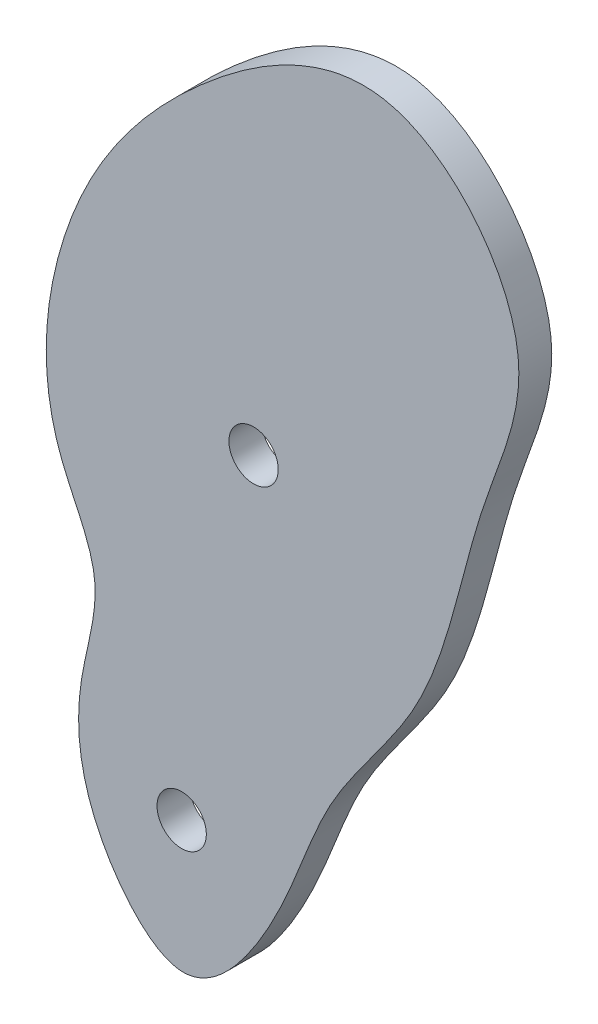
ISO-10303-21;
HEADER;
FILE_DESCRIPTION(('STEP AP214'),'2;1');
FILE_NAME('part.step','',(''),(''),'','','');
FILE_SCHEMA(('AUTOMOTIVE_DESIGN { 1 0 10303 214 1 1 1 1 }'));
ENDSEC;
DATA;
#1=APPLICATION_CONTEXT('core data for automotive mechanical design processes');
#2=APPLICATION_PROTOCOL_DEFINITION('international standard','automotive_design',2000,#1);
#3=PRODUCT_CONTEXT('',#1,'mechanical');
#4=PRODUCT('Part','Part','',(#3));
#5=PRODUCT_RELATED_PRODUCT_CATEGORY('part','',(#4));
#6=PRODUCT_DEFINITION_FORMATION('','',#4);
#7=PRODUCT_DEFINITION_CONTEXT('part definition',#1,'design');
#8=PRODUCT_DEFINITION('design','',#6,#7);
#9=PRODUCT_DEFINITION_SHAPE('','',#8);
#10=(LENGTH_UNIT() NAMED_UNIT(*) SI_UNIT(.MILLI.,.METRE.));
#11=(NAMED_UNIT(*) PLANE_ANGLE_UNIT() SI_UNIT($,.RADIAN.));
#12=(NAMED_UNIT(*) SI_UNIT($,.STERADIAN.) SOLID_ANGLE_UNIT());
#13=UNCERTAINTY_MEASURE_WITH_UNIT(LENGTH_MEASURE(1.E-05),#10,'distance_accuracy_value','');
#14=(GEOMETRIC_REPRESENTATION_CONTEXT(3) GLOBAL_UNCERTAINTY_ASSIGNED_CONTEXT((#13)) GLOBAL_UNIT_ASSIGNED_CONTEXT((#10,
#11,#12)) REPRESENTATION_CONTEXT('',''));
#15=CARTESIAN_POINT('',(0.,0.,0.));
#16=DIRECTION('',(0.,0.,1.));
#17=DIRECTION('',(1.,0.,0.));
#18=AXIS2_PLACEMENT_3D('',#15,#16,#17);
#19=CARTESIAN_POINT('',(325.212447172402,285.760603231583,3.175));
#20=DIRECTION('',(0.,0.,1.));
#21=DIRECTION('',(1.,0.,0.));
#22=AXIS2_PLACEMENT_3D('',#19,#20,#21);
#23=PLANE('',#22);
#24=CARTESIAN_POINT('',(299.663894036164,264.847271209584,3.175));
#25=DIRECTION('',(0.,0.,1.));
#26=DIRECTION('',(1.,0.,0.));
#27=AXIS2_PLACEMENT_3D('',#24,#25,#26);
#28=CIRCLE('',#27,2.38125000000001);
#29=CARTESIAN_POINT('',(302.045144036164,264.847271209584,3.175));
#30=VERTEX_POINT('',#29);
#31=EDGE_CURVE('E44',#30,#30,#28,.T.);
#32=ORIENTED_EDGE('',*,*,#31,.F.);
#33=EDGE_LOOP('',(#32));
#34=FACE_BOUND('',#33,.T.);
#35=CARTESIAN_POINT('',(283.055144989927,237.827067537348,3.175));
#36=CARTESIAN_POINT('',(282.331103986597,233.278959214375,3.175));
#37=CARTESIAN_POINT('',(283.394591113826,225.724364450462,3.175));
#38=CARTESIAN_POINT('',(293.420219347131,214.663935577412,3.175));
#39=CARTESIAN_POINT('',(303.037749510358,227.739852531928,3.175));
#40=CARTESIAN_POINT('',(305.97492707591,239.730178242205,3.175));
#41=CARTESIAN_POINT('',(318.003950983329,252.959767112189,3.175));
#42=CARTESIAN_POINT('',(320.196895259369,269.71363934042,3.175));
#43=CARTESIAN_POINT('',(328.645034259158,287.265736465732,3.175));
#44=CARTESIAN_POINT('',(313.314576682695,306.294257446096,3.175));
#45=CARTESIAN_POINT('',(292.053750530681,293.066129838251,3.175));
#46=CARTESIAN_POINT('',(280.24930244613,276.578122361624,3.175));
#47=CARTESIAN_POINT('',(278.55889342327,258.013088166457,3.175));
#48=CARTESIAN_POINT('',(285.752440350393,247.114148412854,3.175));
#49=CARTESIAN_POINT('',(283.547387231534,240.919117608649,3.175));
#50=CARTESIAN_POINT('',(283.055144989927,237.827067537348,3.175));
#51=B_SPLINE_CURVE_WITH_KNOTS('',3,(#35,#36,#37,#38,#39,#40,#41,#42,#43,#44,#45,#46,#47,#48,#49,
#50),.UNSPECIFIED.,.T.,.F.,(4,1,1,1,1,1,1,1,1,1,1,1,1,4),(0.,0.0684452890054912,
0.116164678428026,0.174355721210676,0.249652140736046,0.318786133705246,0.429139586047155,
0.50078916208045,0.598129491245813,0.694869565997592,0.815864885987732,0.908100631732997,
0.953467189934629,1.),.UNSPECIFIED.);
#52=CARTESIAN_POINT('',(283.055144989927,237.827067537348,3.175));
#53=VERTEX_POINT('',#52);
#54=EDGE_CURVE('E10',#53,#53,#51,.T.);
#55=ORIENTED_EDGE('',*,*,#54,.T.);
#56=EDGE_LOOP('',(#55));
#57=FACE_BOUND('',#56,.T.);
#58=CARTESIAN_POINT('',(292.722924285498,230.886097786682,3.175));
#59=DIRECTION('',(0.,0.,1.));
#60=DIRECTION('',(1.,0.,0.));
#61=AXIS2_PLACEMENT_3D('',#58,#59,#60);
#62=CIRCLE('',#61,2.38125);
#63=CARTESIAN_POINT('',(295.104174285498,230.886097786682,3.175));
#64=VERTEX_POINT('',#63);
#65=EDGE_CURVE('E55',#64,#64,#62,.T.);
#66=ORIENTED_EDGE('',*,*,#65,.F.);
#67=EDGE_LOOP('',(#66));
#68=FACE_BOUND('',#67,.T.);
#69=ADVANCED_FACE('F31',(#34,#57,#68),#23,.T.);
#70=CARTESIAN_POINT('',(325.212447172402,285.760603231583,0.));
#71=DIRECTION('',(0.,0.,1.));
#72=DIRECTION('',(1.,0.,0.));
#73=AXIS2_PLACEMENT_3D('',#70,#71,#72);
#74=PLANE('',#73);
#75=CARTESIAN_POINT('',(283.055144989927,237.827067537348,0.));
#76=CARTESIAN_POINT('',(282.331103986597,233.278959214375,0.));
#77=CARTESIAN_POINT('',(283.394591113826,225.724364450462,0.));
#78=CARTESIAN_POINT('',(293.420219347131,214.663935577412,0.));
#79=CARTESIAN_POINT('',(303.037749510358,227.739852531928,0.));
#80=CARTESIAN_POINT('',(305.97492707591,239.730178242205,0.));
#81=CARTESIAN_POINT('',(318.003950983329,252.959767112189,0.));
#82=CARTESIAN_POINT('',(320.196895259369,269.71363934042,0.));
#83=CARTESIAN_POINT('',(328.645034259158,287.265736465732,0.));
#84=CARTESIAN_POINT('',(313.314576682695,306.294257446096,0.));
#85=CARTESIAN_POINT('',(292.053750530681,293.066129838251,0.));
#86=CARTESIAN_POINT('',(280.24930244613,276.578122361624,0.));
#87=CARTESIAN_POINT('',(278.55889342327,258.013088166457,0.));
#88=CARTESIAN_POINT('',(285.752440350393,247.114148412854,0.));
#89=CARTESIAN_POINT('',(283.547387231534,240.919117608649,0.));
#90=CARTESIAN_POINT('',(283.055144989927,237.827067537348,0.));
#91=B_SPLINE_CURVE_WITH_KNOTS('',3,(#75,#76,#77,#78,#79,#80,#81,#82,#83,#84,#85,#86,#87,#88,#89,
#90),.UNSPECIFIED.,.T.,.F.,(4,1,1,1,1,1,1,1,1,1,1,1,1,4),(0.,0.0684452890054912,
0.116164678428026,0.174355721210676,0.249652140736046,0.318786133705246,0.429139586047155,
0.50078916208045,0.598129491245813,0.694869565997592,0.815864885987732,0.908100631732997,
0.953467189934629,1.),.UNSPECIFIED.);
#92=CARTESIAN_POINT('',(283.055144989927,237.827067537348,0.));
#93=VERTEX_POINT('',#92);
#94=EDGE_CURVE('E36',#93,#93,#91,.T.);
#95=ORIENTED_EDGE('',*,*,#94,.F.);
#96=EDGE_LOOP('',(#95));
#97=FACE_BOUND('',#96,.T.);
#98=CARTESIAN_POINT('',(299.663894036164,264.847271209584,0.));
#99=DIRECTION('',(0.,0.,1.));
#100=DIRECTION('',(1.,0.,0.));
#101=AXIS2_PLACEMENT_3D('',#98,#99,#100);
#102=CIRCLE('',#101,2.38125000000001);
#103=CARTESIAN_POINT('',(302.045144036164,264.847271209584,0.));
#104=VERTEX_POINT('',#103);
#105=EDGE_CURVE('E49',#104,#104,#102,.T.);
#106=ORIENTED_EDGE('',*,*,#105,.T.);
#107=EDGE_LOOP('',(#106));
#108=FACE_BOUND('',#107,.T.);
#109=CARTESIAN_POINT('',(292.722924285498,230.886097786682,0.));
#110=DIRECTION('',(0.,0.,1.));
#111=DIRECTION('',(1.,0.,0.));
#112=AXIS2_PLACEMENT_3D('',#109,#110,#111);
#113=CIRCLE('',#112,2.38125);
#114=CARTESIAN_POINT('',(295.104174285498,230.886097786682,0.));
#115=VERTEX_POINT('',#114);
#116=EDGE_CURVE('E58',#115,#115,#113,.T.);
#117=ORIENTED_EDGE('',*,*,#116,.T.);
#118=EDGE_LOOP('',(#117));
#119=FACE_BOUND('',#118,.T.);
#120=ADVANCED_FACE('F68',(#97,#108,#119),#74,.F.);
#121=DIRECTION('',(0.,0.,-1.));
#122=VECTOR('',#121,1.);
#123=SURFACE_OF_LINEAR_EXTRUSION('',#51,#122);
#124=ORIENTED_EDGE('',*,*,#54,.F.);
#125=EDGE_LOOP('',(#124));
#126=FACE_BOUND('',#125,.T.);
#127=ORIENTED_EDGE('',*,*,#94,.T.);
#128=EDGE_LOOP('',(#127));
#129=FACE_BOUND('',#128,.T.);
#130=ADVANCED_FACE('F33',(#126,#129),#123,.F.);
#131=CARTESIAN_POINT('',(299.663894036164,264.847271209584,3.175));
#132=DIRECTION('',(0.,0.,-1.));
#133=DIRECTION('',(-1.,0.,0.));
#134=AXIS2_PLACEMENT_3D('',#131,#132,#133);
#135=CYLINDRICAL_SURFACE('',#134,2.38125000000001);
#136=ORIENTED_EDGE('',*,*,#31,.T.);
#137=EDGE_LOOP('',(#136));
#138=FACE_BOUND('',#137,.T.);
#139=ORIENTED_EDGE('',*,*,#105,.F.);
#140=EDGE_LOOP('',(#139));
#141=FACE_BOUND('',#140,.T.);
#142=ADVANCED_FACE('F77',(#138,#141),#135,.F.);
#143=CARTESIAN_POINT('',(292.722924285498,230.886097786682,3.175));
#144=DIRECTION('',(0.,0.,-1.));
#145=DIRECTION('',(-1.,0.,0.));
#146=AXIS2_PLACEMENT_3D('',#143,#144,#145);
#147=CYLINDRICAL_SURFACE('',#146,2.38125);
#148=ORIENTED_EDGE('',*,*,#65,.T.);
#149=EDGE_LOOP('',(#148));
#150=FACE_BOUND('',#149,.T.);
#151=ORIENTED_EDGE('',*,*,#116,.F.);
#152=EDGE_LOOP('',(#151));
#153=FACE_BOUND('',#152,.T.);
#154=ADVANCED_FACE('F64',(#150,#153),#147,.F.);
#155=CLOSED_SHELL('',(#69,#120,#130,#142,#154));
#156=MANIFOLD_SOLID_BREP('B2',#155);
#157=ADVANCED_BREP_SHAPE_REPRESENTATION('',(#18,#156),#14);
#158=SHAPE_DEFINITION_REPRESENTATION(#9,#157);
ENDSEC;
END-ISO-10303-21;
